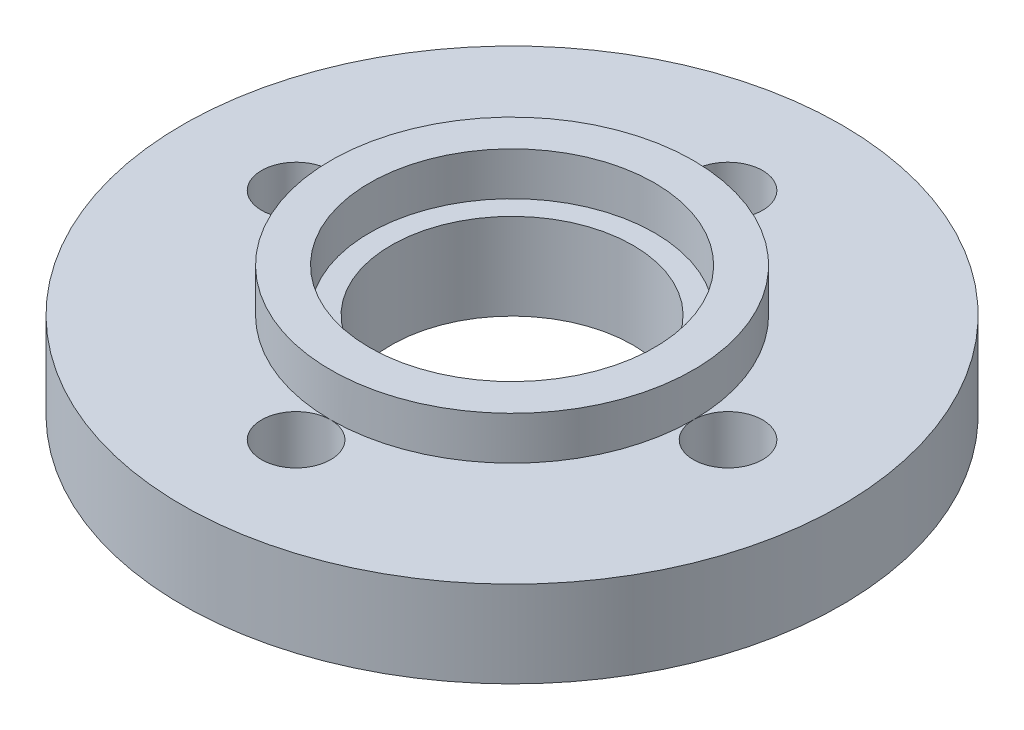
ISO-10303-21;
HEADER;
FILE_DESCRIPTION(('STEP AP214'),'2;1');
FILE_NAME('part.step','',(''),(''),'','','');
FILE_SCHEMA(('AUTOMOTIVE_DESIGN { 1 0 10303 214 1 1 1 1 }'));
ENDSEC;
DATA;
#1=APPLICATION_CONTEXT('core data for automotive mechanical design processes');
#2=APPLICATION_PROTOCOL_DEFINITION('international standard','automotive_design',2000,#1);
#3=PRODUCT_CONTEXT('',#1,'mechanical');
#4=PRODUCT('Part','Part','',(#3));
#5=PRODUCT_RELATED_PRODUCT_CATEGORY('part','',(#4));
#6=PRODUCT_DEFINITION_FORMATION('','',#4);
#7=PRODUCT_DEFINITION_CONTEXT('part definition',#1,'design');
#8=PRODUCT_DEFINITION('design','',#6,#7);
#9=PRODUCT_DEFINITION_SHAPE('','',#8);
#10=(LENGTH_UNIT() NAMED_UNIT(*) SI_UNIT(.MILLI.,.METRE.));
#11=(NAMED_UNIT(*) PLANE_ANGLE_UNIT() SI_UNIT($,.RADIAN.));
#12=(NAMED_UNIT(*) SI_UNIT($,.STERADIAN.) SOLID_ANGLE_UNIT());
#13=UNCERTAINTY_MEASURE_WITH_UNIT(LENGTH_MEASURE(1.E-05),#10,'distance_accuracy_value','');
#14=(GEOMETRIC_REPRESENTATION_CONTEXT(3) GLOBAL_UNCERTAINTY_ASSIGNED_CONTEXT((#13)) GLOBAL_UNIT_ASSIGNED_CONTEXT((#10,
#11,#12)) REPRESENTATION_CONTEXT('',''));
#15=CARTESIAN_POINT('',(0.,0.,0.));
#16=DIRECTION('',(0.,0.,1.));
#17=DIRECTION('',(1.,0.,0.));
#18=AXIS2_PLACEMENT_3D('',#15,#16,#17);
#19=CARTESIAN_POINT('',(16.5,10.2335717384891,0.));
#20=DIRECTION('',(0.,1.,0.));
#21=DIRECTION('',(0.,0.,1.));
#22=AXIS2_PLACEMENT_3D('',#19,#20,#21);
#23=PLANE('',#22);
#24=CARTESIAN_POINT('',(0.,10.2335717384891,0.));
#25=DIRECTION('',(0.,-1.,0.));
#26=DIRECTION('',(0.,0.,-1.));
#27=AXIS2_PLACEMENT_3D('',#24,#25,#26);
#28=CIRCLE('',#27,14.);
#29=CARTESIAN_POINT('',(0.,10.2335717384891,-14.));
#30=VERTEX_POINT('',#29);
#31=EDGE_CURVE('E11',#30,#30,#28,.T.);
#32=ORIENTED_EDGE('',*,*,#31,.T.);
#33=EDGE_LOOP('',(#32));
#34=FACE_BOUND('',#33,.T.);
#35=CARTESIAN_POINT('',(0.,10.2335717384891,0.));
#36=DIRECTION('',(0.,-1.,0.));
#37=DIRECTION('',(0.,0.,-1.));
#38=AXIS2_PLACEMENT_3D('',#35,#36,#37);
#39=CIRCLE('',#38,16.5);
#40=CARTESIAN_POINT('',(0.,10.2335717384891,-16.5));
#41=VERTEX_POINT('',#40);
#42=EDGE_CURVE('E88',#41,#41,#39,.T.);
#43=ORIENTED_EDGE('',*,*,#42,.F.);
#44=EDGE_LOOP('',(#43));
#45=FACE_BOUND('',#44,.T.);
#46=ADVANCED_FACE('F40',(#34,#45),#23,.T.);
#47=CARTESIAN_POINT('',(0.,0.,0.));
#48=DIRECTION('',(0.,-1.,0.));
#49=DIRECTION('',(0.,0.,-1.));
#50=AXIS2_PLACEMENT_3D('',#47,#48,#49);
#51=CYLINDRICAL_SURFACE('',#50,14.);
#52=CARTESIAN_POINT('',(0.,0.233571738489083,0.));
#53=DIRECTION('',(0.,-1.,0.));
#54=DIRECTION('',(0.,0.,-1.));
#55=AXIS2_PLACEMENT_3D('',#52,#53,#54);
#56=CIRCLE('',#55,14.);
#57=CARTESIAN_POINT('',(0.,0.233571738489083,-14.));
#58=VERTEX_POINT('',#57);
#59=EDGE_CURVE('E47',#58,#58,#56,.T.);
#60=ORIENTED_EDGE('',*,*,#59,.T.);
#61=EDGE_LOOP('',(#60));
#62=FACE_BOUND('',#61,.T.);
#63=ORIENTED_EDGE('',*,*,#31,.F.);
#64=EDGE_LOOP('',(#63));
#65=FACE_BOUND('',#64,.T.);
#66=ADVANCED_FACE('F109',(#62,#65),#51,.F.);
#67=CARTESIAN_POINT('',(14.,0.233571738489083,0.));
#68=DIRECTION('',(0.,-1.,0.));
#69=DIRECTION('',(0.,0.,-1.));
#70=AXIS2_PLACEMENT_3D('',#67,#68,#69);
#71=PLANE('',#70);
#72=CARTESIAN_POINT('',(25.,0.233571738489083,0.));
#73=DIRECTION('',(0.,-1.,0.));
#74=DIRECTION('',(0.,0.,-1.));
#75=AXIS2_PLACEMENT_3D('',#72,#73,#74);
#76=CIRCLE('',#75,4.);
#77=CARTESIAN_POINT('',(25.,0.233571738489083,-4.));
#78=VERTEX_POINT('',#77);
#79=EDGE_CURVE('E80',#78,#78,#76,.F.);
#80=ORIENTED_EDGE('',*,*,#79,.T.);
#81=EDGE_LOOP('',(#80));
#82=FACE_BOUND('',#81,.T.);
#83=CARTESIAN_POINT('',(0.,0.233571738489083,-25.));
#84=DIRECTION('',(0.,-1.,0.));
#85=DIRECTION('',(0.,0.,-1.));
#86=AXIS2_PLACEMENT_3D('',#83,#84,#85);
#87=CIRCLE('',#86,4.);
#88=CARTESIAN_POINT('',(0.,0.233571738489083,-29.));
#89=VERTEX_POINT('',#88);
#90=EDGE_CURVE('E71',#89,#89,#87,.F.);
#91=ORIENTED_EDGE('',*,*,#90,.T.);
#92=EDGE_LOOP('',(#91));
#93=FACE_BOUND('',#92,.T.);
#94=CARTESIAN_POINT('',(-25.,0.233571738489083,1.74574066942157E-13));
#95=DIRECTION('',(0.,-1.,0.));
#96=DIRECTION('',(0.,0.,-1.));
#97=AXIS2_PLACEMENT_3D('',#94,#95,#96);
#98=CIRCLE('',#97,4.);
#99=CARTESIAN_POINT('',(-25.,0.233571738489083,-3.99999999999983));
#100=VERTEX_POINT('',#99);
#101=EDGE_CURVE('E72',#100,#100,#98,.F.);
#102=ORIENTED_EDGE('',*,*,#101,.T.);
#103=EDGE_LOOP('',(#102));
#104=FACE_BOUND('',#103,.T.);
#105=CARTESIAN_POINT('',(2.61861100413235E-13,0.233571738489083,25.));
#106=DIRECTION('',(0.,-1.,0.));
#107=DIRECTION('',(0.,0.,-1.));
#108=AXIS2_PLACEMENT_3D('',#105,#106,#107);
#109=CIRCLE('',#108,4.);
#110=CARTESIAN_POINT('',(2.61861100413235E-13,0.233571738489083,21.));
#111=VERTEX_POINT('',#110);
#112=EDGE_CURVE('E83',#111,#111,#109,.F.);
#113=ORIENTED_EDGE('',*,*,#112,.T.);
#114=EDGE_LOOP('',(#113));
#115=FACE_BOUND('',#114,.T.);
#116=CARTESIAN_POINT('',(0.,0.233571738489083,0.));
#117=DIRECTION('',(0.,-1.,0.));
#118=DIRECTION('',(0.,0.,-1.));
#119=AXIS2_PLACEMENT_3D('',#116,#117,#118);
#120=CIRCLE('',#119,38.1500939270196);
#121=CARTESIAN_POINT('',(0.,0.233571738489083,-38.1500939270196));
#122=VERTEX_POINT('',#121);
#123=EDGE_CURVE('E104',#122,#122,#120,.T.);
#124=ORIENTED_EDGE('',*,*,#123,.T.);
#125=EDGE_LOOP('',(#124));
#126=FACE_BOUND('',#125,.T.);
#127=ORIENTED_EDGE('',*,*,#59,.F.);
#128=EDGE_LOOP('',(#127));
#129=FACE_BOUND('',#128,.T.);
#130=ADVANCED_FACE('F112',(#82,#93,#104,#115,#126,#129),#71,.T.);
#131=CARTESIAN_POINT('',(0.,0.,0.));
#132=DIRECTION('',(0.,-1.,0.));
#133=DIRECTION('',(0.,0.,-1.));
#134=AXIS2_PLACEMENT_3D('',#131,#132,#133);
#135=CYLINDRICAL_SURFACE('',#134,38.1500939270196);
#136=CARTESIAN_POINT('',(0.,10.2335717384891,0.));
#137=DIRECTION('',(0.,-1.,0.));
#138=DIRECTION('',(0.,0.,-1.));
#139=AXIS2_PLACEMENT_3D('',#136,#137,#138);
#140=CIRCLE('',#139,38.1500939270196);
#141=CARTESIAN_POINT('',(0.,10.2335717384891,-38.1500939270196));
#142=VERTEX_POINT('',#141);
#143=EDGE_CURVE('E100',#142,#142,#140,.T.);
#144=ORIENTED_EDGE('',*,*,#143,.T.);
#145=EDGE_LOOP('',(#144));
#146=FACE_BOUND('',#145,.T.);
#147=ORIENTED_EDGE('',*,*,#123,.F.);
#148=EDGE_LOOP('',(#147));
#149=FACE_BOUND('',#148,.T.);
#150=ADVANCED_FACE('F114',(#146,#149),#135,.T.);
#151=CARTESIAN_POINT('',(38.1500939270196,10.2335717384891,0.));
#152=DIRECTION('',(0.,1.,0.));
#153=DIRECTION('',(0.,0.,1.));
#154=AXIS2_PLACEMENT_3D('',#151,#152,#153);
#155=PLANE('',#154);
#156=CARTESIAN_POINT('',(0.,10.2335717384891,0.));
#157=DIRECTION('',(0.,-1.,0.));
#158=DIRECTION('',(0.,0.,-1.));
#159=AXIS2_PLACEMENT_3D('',#156,#157,#158);
#160=CIRCLE('',#159,21.);
#161=CARTESIAN_POINT('',(0.,10.2335717384891,-21.));
#162=VERTEX_POINT('',#161);
#163=CARTESIAN_POINT('',(21.,10.2335717384891,0.));
#164=VERTEX_POINT('',#163);
#165=EDGE_CURVE('E98',#162,#164,#160,.T.);
#166=ORIENTED_EDGE('',*,*,#165,.T.);
#167=CARTESIAN_POINT('',(25.,10.2335717384891,0.));
#168=DIRECTION('',(0.,1.,0.));
#169=DIRECTION('',(0.,0.,1.));
#170=AXIS2_PLACEMENT_3D('',#167,#168,#169);
#171=CIRCLE('',#170,4.);
#172=EDGE_CURVE('E75',#164,#164,#171,.T.);
#173=ORIENTED_EDGE('',*,*,#172,.F.);
#174=CARTESIAN_POINT('',(0.,10.2335717384891,21.));
#175=VERTEX_POINT('',#174);
#176=EDGE_CURVE('E101',#164,#175,#160,.T.);
#177=ORIENTED_EDGE('',*,*,#176,.T.);
#178=CARTESIAN_POINT('',(2.61861100413235E-13,10.2335717384891,25.));
#179=DIRECTION('',(0.,1.,0.));
#180=DIRECTION('',(0.,0.,1.));
#181=AXIS2_PLACEMENT_3D('',#178,#179,#180);
#182=CIRCLE('',#181,4.);
#183=EDGE_CURVE('E57',#175,#175,#182,.T.);
#184=ORIENTED_EDGE('',*,*,#183,.F.);
#185=CARTESIAN_POINT('',(-21.,10.2335717384891,1.46642216231412E-13));
#186=VERTEX_POINT('',#185);
#187=EDGE_CURVE('E251',#175,#186,#160,.T.);
#188=ORIENTED_EDGE('',*,*,#187,.T.);
#189=CARTESIAN_POINT('',(-25.,10.2335717384891,1.74574066942157E-13));
#190=DIRECTION('',(0.,1.,0.));
#191=DIRECTION('',(0.,0.,1.));
#192=AXIS2_PLACEMENT_3D('',#189,#190,#191);
#193=CIRCLE('',#192,4.);
#194=EDGE_CURVE('E52',#186,#186,#193,.T.);
#195=ORIENTED_EDGE('',*,*,#194,.F.);
#196=EDGE_CURVE('E97',#186,#162,#160,.T.);
#197=ORIENTED_EDGE('',*,*,#196,.T.);
#198=CARTESIAN_POINT('',(0.,10.2335717384891,-25.));
#199=DIRECTION('',(0.,1.,0.));
#200=DIRECTION('',(0.,0.,1.));
#201=AXIS2_PLACEMENT_3D('',#198,#199,#200);
#202=CIRCLE('',#201,4.);
#203=EDGE_CURVE('E65',#162,#162,#202,.T.);
#204=ORIENTED_EDGE('',*,*,#203,.F.);
#205=EDGE_LOOP('',(#166,#173,#177,#184,#188,#195,#197,#204));
#206=FACE_BOUND('',#205,.T.);
#207=ORIENTED_EDGE('',*,*,#143,.F.);
#208=EDGE_LOOP('',(#207));
#209=FACE_BOUND('',#208,.T.);
#210=ADVANCED_FACE('F121',(#206,#209),#155,.T.);
#211=CARTESIAN_POINT('',(0.,0.,0.));
#212=DIRECTION('',(0.,-1.,0.));
#213=DIRECTION('',(0.,0.,-1.));
#214=AXIS2_PLACEMENT_3D('',#211,#212,#213);
#215=CYLINDRICAL_SURFACE('',#214,21.);
#216=CARTESIAN_POINT('',(0.,15.2335717384891,0.));
#217=DIRECTION('',(0.,-1.,0.));
#218=DIRECTION('',(0.,0.,-1.));
#219=AXIS2_PLACEMENT_3D('',#216,#217,#218);
#220=CIRCLE('',#219,21.);
#221=CARTESIAN_POINT('',(0.,15.2335717384891,-21.));
#222=VERTEX_POINT('',#221);
#223=EDGE_CURVE('E94',#222,#222,#220,.T.);
#224=ORIENTED_EDGE('',*,*,#223,.T.);
#225=EDGE_LOOP('',(#224));
#226=FACE_BOUND('',#225,.T.);
#227=ORIENTED_EDGE('',*,*,#165,.F.);
#228=ORIENTED_EDGE('',*,*,#196,.F.);
#229=ORIENTED_EDGE('',*,*,#187,.F.);
#230=ORIENTED_EDGE('',*,*,#176,.F.);
#231=EDGE_LOOP('',(#227,#228,#229,#230));
#232=FACE_BOUND('',#231,.T.);
#233=ADVANCED_FACE('F144',(#226,#232),#215,.T.);
#234=CARTESIAN_POINT('',(21.,15.2335717384891,0.));
#235=DIRECTION('',(0.,1.,0.));
#236=DIRECTION('',(0.,0.,1.));
#237=AXIS2_PLACEMENT_3D('',#234,#235,#236);
#238=PLANE('',#237);
#239=CARTESIAN_POINT('',(0.,15.2335717384891,0.));
#240=DIRECTION('',(0.,-1.,0.));
#241=DIRECTION('',(0.,0.,-1.));
#242=AXIS2_PLACEMENT_3D('',#239,#240,#241);
#243=CIRCLE('',#242,16.5);
#244=CARTESIAN_POINT('',(0.,15.2335717384891,-16.5));
#245=VERTEX_POINT('',#244);
#246=EDGE_CURVE('E91',#245,#245,#243,.T.);
#247=ORIENTED_EDGE('',*,*,#246,.T.);
#248=EDGE_LOOP('',(#247));
#249=FACE_BOUND('',#248,.T.);
#250=ORIENTED_EDGE('',*,*,#223,.F.);
#251=EDGE_LOOP('',(#250));
#252=FACE_BOUND('',#251,.T.);
#253=ADVANCED_FACE('F138',(#249,#252),#238,.T.);
#254=CARTESIAN_POINT('',(0.,0.,0.));
#255=DIRECTION('',(0.,-1.,0.));
#256=DIRECTION('',(0.,0.,-1.));
#257=AXIS2_PLACEMENT_3D('',#254,#255,#256);
#258=CYLINDRICAL_SURFACE('',#257,16.5);
#259=ORIENTED_EDGE('',*,*,#42,.T.);
#260=EDGE_LOOP('',(#259));
#261=FACE_BOUND('',#260,.T.);
#262=ORIENTED_EDGE('',*,*,#246,.F.);
#263=EDGE_LOOP('',(#262));
#264=FACE_BOUND('',#263,.T.);
#265=ADVANCED_FACE('F134',(#261,#264),#258,.F.);
#266=CARTESIAN_POINT('',(2.61861100413235E-13,-11.0801367604957,25.));
#267=DIRECTION('',(0.,1.,0.));
#268=DIRECTION('',(0.,0.,1.));
#269=AXIS2_PLACEMENT_3D('',#266,#267,#268);
#270=CYLINDRICAL_SURFACE('',#269,4.);
#271=ORIENTED_EDGE('',*,*,#183,.T.);
#272=EDGE_LOOP('',(#271));
#273=FACE_BOUND('',#272,.T.);
#274=ORIENTED_EDGE('',*,*,#112,.F.);
#275=EDGE_LOOP('',(#274));
#276=FACE_BOUND('',#275,.T.);
#277=ADVANCED_FACE('F137',(#273,#276),#270,.F.);
#278=CARTESIAN_POINT('',(-25.,-11.0801367604957,1.74574066942157E-13));
#279=DIRECTION('',(0.,1.,0.));
#280=DIRECTION('',(0.,0.,1.));
#281=AXIS2_PLACEMENT_3D('',#278,#279,#280);
#282=CYLINDRICAL_SURFACE('',#281,4.);
#283=ORIENTED_EDGE('',*,*,#194,.T.);
#284=EDGE_LOOP('',(#283));
#285=FACE_BOUND('',#284,.T.);
#286=ORIENTED_EDGE('',*,*,#101,.F.);
#287=EDGE_LOOP('',(#286));
#288=FACE_BOUND('',#287,.T.);
#289=ADVANCED_FACE('F168',(#285,#288),#282,.F.);
#290=CARTESIAN_POINT('',(0.,-11.0801367604957,-25.));
#291=DIRECTION('',(0.,1.,0.));
#292=DIRECTION('',(0.,0.,1.));
#293=AXIS2_PLACEMENT_3D('',#290,#291,#292);
#294=CYLINDRICAL_SURFACE('',#293,4.);
#295=ORIENTED_EDGE('',*,*,#203,.T.);
#296=EDGE_LOOP('',(#295));
#297=FACE_BOUND('',#296,.T.);
#298=ORIENTED_EDGE('',*,*,#90,.F.);
#299=EDGE_LOOP('',(#298));
#300=FACE_BOUND('',#299,.T.);
#301=ADVANCED_FACE('F66',(#297,#300),#294,.F.);
#302=CARTESIAN_POINT('',(25.,-11.0801367604957,0.));
#303=DIRECTION('',(0.,1.,0.));
#304=DIRECTION('',(0.,0.,1.));
#305=AXIS2_PLACEMENT_3D('',#302,#303,#304);
#306=CYLINDRICAL_SURFACE('',#305,4.);
#307=ORIENTED_EDGE('',*,*,#172,.T.);
#308=EDGE_LOOP('',(#307));
#309=FACE_BOUND('',#308,.T.);
#310=ORIENTED_EDGE('',*,*,#79,.F.);
#311=EDGE_LOOP('',(#310));
#312=FACE_BOUND('',#311,.T.);
#313=ADVANCED_FACE('F162',(#309,#312),#306,.F.);
#314=CLOSED_SHELL('',(#46,#66,#130,#150,#210,#233,#253,#265,#277,#289,#301,#313));
#315=MANIFOLD_SOLID_BREP('B2',#314);
#316=ADVANCED_BREP_SHAPE_REPRESENTATION('',(#18,#315),#14);
#317=SHAPE_DEFINITION_REPRESENTATION(#9,#316);
ENDSEC;
END-ISO-10303-21;
